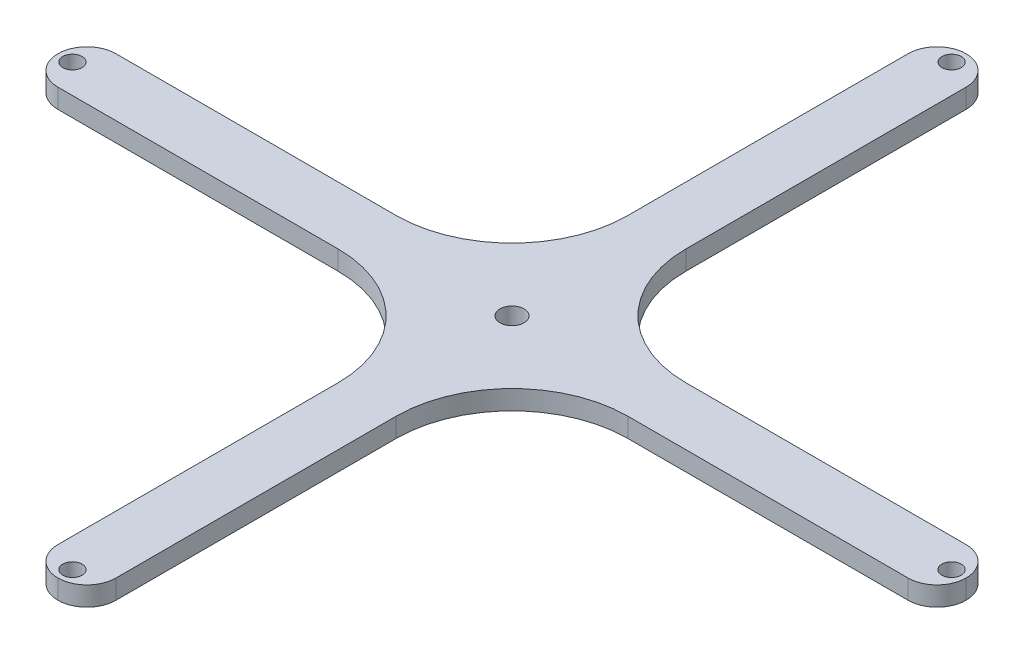
ISO-10303-21;
HEADER;
FILE_DESCRIPTION(('STEP AP214'),'2;1');
FILE_NAME('part.step','',(''),(''),'','','');
FILE_SCHEMA(('AUTOMOTIVE_DESIGN { 1 0 10303 214 1 1 1 1 }'));
ENDSEC;
DATA;
#1=APPLICATION_CONTEXT('core data for automotive mechanical design processes');
#2=APPLICATION_PROTOCOL_DEFINITION('international standard','automotive_design',2000,#1);
#3=PRODUCT_CONTEXT('',#1,'mechanical');
#4=PRODUCT('Part','Part','',(#3));
#5=PRODUCT_RELATED_PRODUCT_CATEGORY('part','',(#4));
#6=PRODUCT_DEFINITION_FORMATION('','',#4);
#7=PRODUCT_DEFINITION_CONTEXT('part definition',#1,'design');
#8=PRODUCT_DEFINITION('design','',#6,#7);
#9=PRODUCT_DEFINITION_SHAPE('','',#8);
#10=(LENGTH_UNIT() NAMED_UNIT(*) SI_UNIT(.MILLI.,.METRE.));
#11=(NAMED_UNIT(*) PLANE_ANGLE_UNIT() SI_UNIT($,.RADIAN.));
#12=(NAMED_UNIT(*) SI_UNIT($,.STERADIAN.) SOLID_ANGLE_UNIT());
#13=UNCERTAINTY_MEASURE_WITH_UNIT(LENGTH_MEASURE(1.E-05),#10,'distance_accuracy_value','');
#14=(GEOMETRIC_REPRESENTATION_CONTEXT(3) GLOBAL_UNCERTAINTY_ASSIGNED_CONTEXT((#13)) GLOBAL_UNIT_ASSIGNED_CONTEXT((#10,
#11,#12)) REPRESENTATION_CONTEXT('',''));
#15=CARTESIAN_POINT('',(0.,0.,0.));
#16=DIRECTION('',(0.,0.,1.));
#17=DIRECTION('',(1.,0.,0.));
#18=AXIS2_PLACEMENT_3D('',#15,#16,#17);
#19=CARTESIAN_POINT('',(0.,6.35,9.52500000000847));
#20=DIRECTION('',(0.,0.,1.));
#21=DIRECTION('',(1.,0.,0.));
#22=AXIS2_PLACEMENT_3D('',#19,#20,#21);
#23=PLANE('',#22);
#24=DIRECTION('',(-1.,0.,0.));
#25=VECTOR('',#24,1.);
#26=CARTESIAN_POINT('',(0.,6.35,9.52500000000847));
#27=LINE('',#26,#25);
#28=CARTESIAN_POINT('',(139.7,6.35,9.52500000000844));
#29=VERTEX_POINT('',#28);
#30=CARTESIAN_POINT('',(47.625,6.35,9.52500000000846));
#31=VERTEX_POINT('',#30);
#32=EDGE_CURVE('E399',#29,#31,#27,.T.);
#33=ORIENTED_EDGE('',*,*,#32,.T.);
#34=DIRECTION('',(0.,-1.,0.));
#35=VECTOR('',#34,1.);
#36=CARTESIAN_POINT('',(47.625,6.35,9.52500000000846));
#37=LINE('',#36,#35);
#38=CARTESIAN_POINT('',(47.625,0.,9.52500000000846));
#39=VERTEX_POINT('',#38);
#40=EDGE_CURVE('E261',#31,#39,#37,.T.);
#41=ORIENTED_EDGE('',*,*,#40,.T.);
#42=DIRECTION('',(-1.,0.,0.));
#43=VECTOR('',#42,1.);
#44=CARTESIAN_POINT('',(0.,0.,9.52500000000847));
#45=LINE('',#44,#43);
#46=CARTESIAN_POINT('',(139.7,0.,9.52500000000844));
#47=VERTEX_POINT('',#46);
#48=EDGE_CURVE('E438',#47,#39,#45,.T.);
#49=ORIENTED_EDGE('',*,*,#48,.F.);
#50=DIRECTION('',(0.,1.,0.));
#51=VECTOR('',#50,1.);
#52=CARTESIAN_POINT('',(139.7,6.35,9.52500000000844));
#53=LINE('',#52,#51);
#54=EDGE_CURVE('E249',#47,#29,#53,.T.);
#55=ORIENTED_EDGE('',*,*,#54,.T.);
#56=EDGE_LOOP('',(#33,#41,#49,#55));
#57=FACE_BOUND('',#56,.T.);
#58=ADVANCED_FACE('F36',(#57),#23,.T.);
#59=CARTESIAN_POINT('',(0.,6.35,-9.52499999999154));
#60=DIRECTION('',(0.,0.,1.));
#61=DIRECTION('',(1.,0.,0.));
#62=AXIS2_PLACEMENT_3D('',#59,#60,#61);
#63=PLANE('',#62);
#64=DIRECTION('',(-1.,0.,0.));
#65=VECTOR('',#64,1.);
#66=CARTESIAN_POINT('',(0.,0.,-9.52499999999154));
#67=LINE('',#66,#65);
#68=CARTESIAN_POINT('',(139.7,0.,-9.52499999999156));
#69=VERTEX_POINT('',#68);
#70=CARTESIAN_POINT('',(47.625,0.,-9.52499999999154));
#71=VERTEX_POINT('',#70);
#72=EDGE_CURVE('E204',#69,#71,#67,.T.);
#73=ORIENTED_EDGE('',*,*,#72,.T.);
#74=DIRECTION('',(0.,-1.,0.));
#75=VECTOR('',#74,1.);
#76=CARTESIAN_POINT('',(47.625,6.35,-9.52499999999154));
#77=LINE('',#76,#75);
#78=CARTESIAN_POINT('',(47.625,6.35,-9.52499999999154));
#79=VERTEX_POINT('',#78);
#80=EDGE_CURVE('E57',#71,#79,#77,.F.);
#81=ORIENTED_EDGE('',*,*,#80,.T.);
#82=DIRECTION('',(-1.,0.,0.));
#83=VECTOR('',#82,1.);
#84=CARTESIAN_POINT('',(0.,6.35,-9.52499999999154));
#85=LINE('',#84,#83);
#86=CARTESIAN_POINT('',(139.7,6.35,-9.52499999999156));
#87=VERTEX_POINT('',#86);
#88=EDGE_CURVE('E405',#87,#79,#85,.T.);
#89=ORIENTED_EDGE('',*,*,#88,.F.);
#90=DIRECTION('',(0.,-1.,0.));
#91=VECTOR('',#90,1.);
#92=CARTESIAN_POINT('',(139.7,6.35,-9.52499999999156));
#93=LINE('',#92,#91);
#94=EDGE_CURVE('E246',#87,#69,#93,.T.);
#95=ORIENTED_EDGE('',*,*,#94,.T.);
#96=EDGE_LOOP('',(#73,#81,#89,#95));
#97=FACE_BOUND('',#96,.T.);
#98=ADVANCED_FACE('F327',(#97),#63,.F.);
#99=CARTESIAN_POINT('',(9.52500000000001,6.35,0.));
#100=DIRECTION('',(1.,0.,0.));
#101=DIRECTION('',(0.,0.,-1.));
#102=AXIS2_PLACEMENT_3D('',#99,#100,#101);
#103=PLANE('',#102);
#104=DIRECTION('',(0.,0.,1.));
#105=VECTOR('',#104,1.);
#106=CARTESIAN_POINT('',(9.52500000000001,6.35,0.));
#107=LINE('',#106,#105);
#108=CARTESIAN_POINT('',(9.525,6.35,-139.7));
#109=VERTEX_POINT('',#108);
#110=CARTESIAN_POINT('',(9.52500000000001,6.35,-47.6249999999915));
#111=VERTEX_POINT('',#110);
#112=EDGE_CURVE('E408',#109,#111,#107,.T.);
#113=ORIENTED_EDGE('',*,*,#112,.T.);
#114=DIRECTION('',(0.,-1.,0.));
#115=VECTOR('',#114,1.);
#116=CARTESIAN_POINT('',(9.52500000000001,6.35,-47.6249999999915));
#117=LINE('',#116,#115);
#118=CARTESIAN_POINT('',(9.52500000000001,0.,-47.6249999999915));
#119=VERTEX_POINT('',#118);
#120=EDGE_CURVE('E287',#111,#119,#117,.T.);
#121=ORIENTED_EDGE('',*,*,#120,.T.);
#122=DIRECTION('',(0.,0.,1.));
#123=VECTOR('',#122,1.);
#124=CARTESIAN_POINT('',(9.52500000000001,0.,0.));
#125=LINE('',#124,#123);
#126=CARTESIAN_POINT('',(9.525,0.,-139.7));
#127=VERTEX_POINT('',#126);
#128=EDGE_CURVE('E200',#127,#119,#125,.T.);
#129=ORIENTED_EDGE('',*,*,#128,.F.);
#130=DIRECTION('',(0.,1.,0.));
#131=VECTOR('',#130,1.);
#132=CARTESIAN_POINT('',(9.525,6.35,-139.7));
#133=LINE('',#132,#131);
#134=EDGE_CURVE('E244',#127,#109,#133,.T.);
#135=ORIENTED_EDGE('',*,*,#134,.T.);
#136=EDGE_LOOP('',(#113,#121,#129,#135));
#137=FACE_BOUND('',#136,.T.);
#138=ADVANCED_FACE('F333',(#137),#103,.T.);
#139=CARTESIAN_POINT('',(-9.52500000000001,6.35,0.));
#140=DIRECTION('',(1.,0.,0.));
#141=DIRECTION('',(0.,0.,-1.));
#142=AXIS2_PLACEMENT_3D('',#139,#140,#141);
#143=PLANE('',#142);
#144=DIRECTION('',(0.,0.,1.));
#145=VECTOR('',#144,1.);
#146=CARTESIAN_POINT('',(-9.52500000000001,0.,0.));
#147=LINE('',#146,#145);
#148=CARTESIAN_POINT('',(-9.525,0.,-139.7));
#149=VERTEX_POINT('',#148);
#150=CARTESIAN_POINT('',(-9.52500000000001,0.,-47.6249999999915));
#151=VERTEX_POINT('',#150);
#152=EDGE_CURVE('E189',#149,#151,#147,.T.);
#153=ORIENTED_EDGE('',*,*,#152,.T.);
#154=DIRECTION('',(0.,-1.,0.));
#155=VECTOR('',#154,1.);
#156=CARTESIAN_POINT('',(-9.52500000000001,6.35,-47.6249999999915));
#157=LINE('',#156,#155);
#158=CARTESIAN_POINT('',(-9.52500000000001,6.35,-47.6249999999915));
#159=VERTEX_POINT('',#158);
#160=EDGE_CURVE('E285',#151,#159,#157,.F.);
#161=ORIENTED_EDGE('',*,*,#160,.T.);
#162=DIRECTION('',(0.,0.,1.));
#163=VECTOR('',#162,1.);
#164=CARTESIAN_POINT('',(-9.52500000000001,6.35,0.));
#165=LINE('',#164,#163);
#166=CARTESIAN_POINT('',(-9.525,6.35,-139.7));
#167=VERTEX_POINT('',#166);
#168=EDGE_CURVE('E192',#167,#159,#165,.T.);
#169=ORIENTED_EDGE('',*,*,#168,.F.);
#170=DIRECTION('',(0.,-1.,0.));
#171=VECTOR('',#170,1.);
#172=CARTESIAN_POINT('',(-9.525,6.35,-139.7));
#173=LINE('',#172,#171);
#174=EDGE_CURVE('E177',#167,#149,#173,.T.);
#175=ORIENTED_EDGE('',*,*,#174,.T.);
#176=EDGE_LOOP('',(#153,#161,#169,#175));
#177=FACE_BOUND('',#176,.T.);
#178=ADVANCED_FACE('F188',(#177),#143,.F.);
#179=CARTESIAN_POINT('',(0.,6.35,-9.52499999999156));
#180=DIRECTION('',(0.,0.,-1.));
#181=DIRECTION('',(-1.,0.,0.));
#182=AXIS2_PLACEMENT_3D('',#179,#180,#181);
#183=PLANE('',#182);
#184=DIRECTION('',(1.,0.,0.));
#185=VECTOR('',#184,1.);
#186=CARTESIAN_POINT('',(0.,6.35,-9.52499999999156));
#187=LINE('',#186,#185);
#188=CARTESIAN_POINT('',(-139.7,6.35,-9.52499999999151));
#189=VERTEX_POINT('',#188);
#190=CARTESIAN_POINT('',(-47.625,6.35,-9.52499999999154));
#191=VERTEX_POINT('',#190);
#192=EDGE_CURVE('E306',#189,#191,#187,.T.);
#193=ORIENTED_EDGE('',*,*,#192,.T.);
#194=DIRECTION('',(0.,-1.,0.));
#195=VECTOR('',#194,1.);
#196=CARTESIAN_POINT('',(-47.625,6.35,-9.52499999999154));
#197=LINE('',#196,#195);
#198=CARTESIAN_POINT('',(-47.625,0.,-9.52499999999154));
#199=VERTEX_POINT('',#198);
#200=EDGE_CURVE('E282',#191,#199,#197,.T.);
#201=ORIENTED_EDGE('',*,*,#200,.T.);
#202=DIRECTION('',(1.,0.,0.));
#203=VECTOR('',#202,1.);
#204=CARTESIAN_POINT('',(0.,0.,-9.52499999999156));
#205=LINE('',#204,#203);
#206=CARTESIAN_POINT('',(-139.7,0.,-9.52499999999151));
#207=VERTEX_POINT('',#206);
#208=EDGE_CURVE('E199',#207,#199,#205,.T.);
#209=ORIENTED_EDGE('',*,*,#208,.F.);
#210=DIRECTION('',(0.,1.,0.));
#211=VECTOR('',#210,1.);
#212=CARTESIAN_POINT('',(-139.7,6.35,-9.52499999999151));
#213=LINE('',#212,#211);
#214=EDGE_CURVE('E256',#207,#189,#213,.T.);
#215=ORIENTED_EDGE('',*,*,#214,.T.);
#216=EDGE_LOOP('',(#193,#201,#209,#215));
#217=FACE_BOUND('',#216,.T.);
#218=ADVANCED_FACE('F310',(#217),#183,.T.);
#219=CARTESIAN_POINT('',(0.,6.35,9.52500000000847));
#220=DIRECTION('',(0.,0.,-1.));
#221=DIRECTION('',(-1.,0.,0.));
#222=AXIS2_PLACEMENT_3D('',#219,#220,#221);
#223=PLANE('',#222);
#224=DIRECTION('',(1.,0.,0.));
#225=VECTOR('',#224,1.);
#226=CARTESIAN_POINT('',(0.,0.,9.52500000000847));
#227=LINE('',#226,#225);
#228=CARTESIAN_POINT('',(-139.7,0.,9.52500000000849));
#229=VERTEX_POINT('',#228);
#230=CARTESIAN_POINT('',(-47.625,0.,9.52500000000848));
#231=VERTEX_POINT('',#230);
#232=EDGE_CURVE('E202',#229,#231,#227,.T.);
#233=ORIENTED_EDGE('',*,*,#232,.T.);
#234=DIRECTION('',(0.,-1.,0.));
#235=VECTOR('',#234,1.);
#236=CARTESIAN_POINT('',(-47.625,6.35,9.52500000000848));
#237=LINE('',#236,#235);
#238=CARTESIAN_POINT('',(-47.625,6.35,9.52500000000848));
#239=VERTEX_POINT('',#238);
#240=EDGE_CURVE('E280',#231,#239,#237,.F.);
#241=ORIENTED_EDGE('',*,*,#240,.T.);
#242=DIRECTION('',(1.,0.,0.));
#243=VECTOR('',#242,1.);
#244=CARTESIAN_POINT('',(0.,6.35,9.52500000000847));
#245=LINE('',#244,#243);
#246=CARTESIAN_POINT('',(-139.7,6.35,9.52500000000849));
#247=VERTEX_POINT('',#246);
#248=EDGE_CURVE('E313',#247,#239,#245,.T.);
#249=ORIENTED_EDGE('',*,*,#248,.F.);
#250=DIRECTION('',(0.,-1.,0.));
#251=VECTOR('',#250,1.);
#252=CARTESIAN_POINT('',(-139.7,6.35,9.52500000000849));
#253=LINE('',#252,#251);
#254=EDGE_CURVE('E259',#247,#229,#253,.T.);
#255=ORIENTED_EDGE('',*,*,#254,.T.);
#256=EDGE_LOOP('',(#233,#241,#249,#255));
#257=FACE_BOUND('',#256,.T.);
#258=ADVANCED_FACE('F455',(#257),#223,.F.);
#259=CARTESIAN_POINT('',(-9.525,6.35,0.));
#260=DIRECTION('',(-1.,0.,0.));
#261=DIRECTION('',(0.,0.,1.));
#262=AXIS2_PLACEMENT_3D('',#259,#260,#261);
#263=PLANE('',#262);
#264=DIRECTION('',(0.,0.,-1.));
#265=VECTOR('',#264,1.);
#266=CARTESIAN_POINT('',(-9.525,6.35,0.));
#267=LINE('',#266,#265);
#268=CARTESIAN_POINT('',(-9.52499999999997,6.35,139.7));
#269=VERTEX_POINT('',#268);
#270=CARTESIAN_POINT('',(-9.52499999999999,6.35,47.6250000000085));
#271=VERTEX_POINT('',#270);
#272=EDGE_CURVE('E420',#269,#271,#267,.T.);
#273=ORIENTED_EDGE('',*,*,#272,.T.);
#274=DIRECTION('',(0.,-1.,0.));
#275=VECTOR('',#274,1.);
#276=CARTESIAN_POINT('',(-9.52499999999999,6.35,47.6250000000085));
#277=LINE('',#276,#275);
#278=CARTESIAN_POINT('',(-9.52499999999999,0.,47.6250000000085));
#279=VERTEX_POINT('',#278);
#280=EDGE_CURVE('E277',#271,#279,#277,.T.);
#281=ORIENTED_EDGE('',*,*,#280,.T.);
#282=DIRECTION('',(0.,0.,-1.));
#283=VECTOR('',#282,1.);
#284=CARTESIAN_POINT('',(-9.525,0.,0.));
#285=LINE('',#284,#283);
#286=CARTESIAN_POINT('',(-9.52499999999997,0.,139.7));
#287=VERTEX_POINT('',#286);
#288=EDGE_CURVE('E210',#287,#279,#285,.T.);
#289=ORIENTED_EDGE('',*,*,#288,.F.);
#290=DIRECTION('',(0.,1.,0.));
#291=VECTOR('',#290,1.);
#292=CARTESIAN_POINT('',(-9.52499999999997,6.35,139.7));
#293=LINE('',#292,#291);
#294=EDGE_CURVE('E254',#287,#269,#293,.T.);
#295=ORIENTED_EDGE('',*,*,#294,.T.);
#296=EDGE_LOOP('',(#273,#281,#289,#295));
#297=FACE_BOUND('',#296,.T.);
#298=ADVANCED_FACE('F342',(#297),#263,.T.);
#299=CARTESIAN_POINT('',(-2.54472745729517E-12,6.35,-144.4625));
#300=DIRECTION('',(0.,-1.,0.));
#301=DIRECTION('',(0.,0.,-1.));
#302=AXIS2_PLACEMENT_3D('',#299,#300,#301);
#303=CYLINDRICAL_SURFACE('',#302,3.17500000000647);
#304=CARTESIAN_POINT('',(-2.54472745729517E-12,6.35,-144.4625));
#305=DIRECTION('',(0.,1.,0.));
#306=DIRECTION('',(0.,0.,1.));
#307=AXIS2_PLACEMENT_3D('',#304,#305,#306);
#308=CIRCLE('',#307,3.17500000000647);
#309=CARTESIAN_POINT('',(-2.54472745729517E-12,6.35,-141.287499999994));
#310=VERTEX_POINT('',#309);
#311=EDGE_CURVE('E406',#310,#310,#308,.T.);
#312=ORIENTED_EDGE('',*,*,#311,.T.);
#313=EDGE_LOOP('',(#312));
#314=FACE_BOUND('',#313,.T.);
#315=CARTESIAN_POINT('',(-2.54472745729517E-12,0.,-144.4625));
#316=DIRECTION('',(0.,1.,0.));
#317=DIRECTION('',(0.,0.,1.));
#318=AXIS2_PLACEMENT_3D('',#315,#316,#317);
#319=CIRCLE('',#318,3.17500000000647);
#320=CARTESIAN_POINT('',(-2.54472745729517E-12,0.,-141.287499999994));
#321=VERTEX_POINT('',#320);
#322=EDGE_CURVE('E435',#321,#321,#319,.T.);
#323=ORIENTED_EDGE('',*,*,#322,.F.);
#324=EDGE_LOOP('',(#323));
#325=FACE_BOUND('',#324,.T.);
#326=ADVANCED_FACE('F338',(#314,#325),#303,.F.);
#327=CARTESIAN_POINT('',(2.55374539373746E-12,6.35,144.462500000017));
#328=DIRECTION('',(0.,-1.,0.));
#329=DIRECTION('',(0.,0.,-1.));
#330=AXIS2_PLACEMENT_3D('',#327,#328,#329);
#331=CYLINDRICAL_SURFACE('',#330,3.17500000002298);
#332=CARTESIAN_POINT('',(2.55374539373746E-12,6.35,144.462500000017));
#333=DIRECTION('',(0.,1.,0.));
#334=DIRECTION('',(0.,0.,1.));
#335=AXIS2_PLACEMENT_3D('',#332,#333,#334);
#336=CIRCLE('',#335,3.17500000002298);
#337=CARTESIAN_POINT('',(2.55374539373746E-12,6.35,147.63750000004));
#338=VERTEX_POINT('',#337);
#339=EDGE_CURVE('E411',#338,#338,#336,.T.);
#340=ORIENTED_EDGE('',*,*,#339,.T.);
#341=EDGE_LOOP('',(#340));
#342=FACE_BOUND('',#341,.T.);
#343=CARTESIAN_POINT('',(2.55374539373746E-12,0.,144.462500000017));
#344=DIRECTION('',(0.,1.,0.));
#345=DIRECTION('',(0.,0.,1.));
#346=AXIS2_PLACEMENT_3D('',#343,#344,#345);
#347=CIRCLE('',#346,3.17500000002298);
#348=CARTESIAN_POINT('',(2.55374539373746E-12,0.,147.63750000004));
#349=VERTEX_POINT('',#348);
#350=EDGE_CURVE('E432',#349,#349,#347,.T.);
#351=ORIENTED_EDGE('',*,*,#350,.F.);
#352=EDGE_LOOP('',(#351));
#353=FACE_BOUND('',#352,.T.);
#354=ADVANCED_FACE('F341',(#342,#353),#331,.F.);
#355=CARTESIAN_POINT('',(144.462500000008,6.35,5.92599147110631E-12));
#356=DIRECTION('',(0.,-1.,0.));
#357=DIRECTION('',(0.,0.,-1.));
#358=AXIS2_PLACEMENT_3D('',#355,#356,#357);
#359=CYLINDRICAL_SURFACE('',#358,3.17500000001223);
#360=CARTESIAN_POINT('',(144.462500000008,6.35,5.92599147110631E-12));
#361=DIRECTION('',(0.,1.,0.));
#362=DIRECTION('',(0.,0.,1.));
#363=AXIS2_PLACEMENT_3D('',#360,#361,#362);
#364=CIRCLE('',#363,3.17500000001223);
#365=CARTESIAN_POINT('',(144.462500000008,6.35,3.17500000001816));
#366=VERTEX_POINT('',#365);
#367=EDGE_CURVE('E482',#366,#366,#364,.T.);
#368=ORIENTED_EDGE('',*,*,#367,.T.);
#369=EDGE_LOOP('',(#368));
#370=FACE_BOUND('',#369,.T.);
#371=CARTESIAN_POINT('',(144.462500000008,0.,5.92599147110631E-12));
#372=DIRECTION('',(0.,1.,0.));
#373=DIRECTION('',(0.,0.,1.));
#374=AXIS2_PLACEMENT_3D('',#371,#372,#373);
#375=CIRCLE('',#374,3.17500000001223);
#376=CARTESIAN_POINT('',(144.462500000008,0.,3.17500000001816));
#377=VERTEX_POINT('',#376);
#378=EDGE_CURVE('E429',#377,#377,#375,.T.);
#379=ORIENTED_EDGE('',*,*,#378,.F.);
#380=EDGE_LOOP('',(#379));
#381=FACE_BOUND('',#380,.T.);
#382=ADVANCED_FACE('F346',(#370,#381),#359,.F.);
#383=CARTESIAN_POINT('',(0.,6.35,0.));
#384=DIRECTION('',(0.,-1.,0.));
#385=DIRECTION('',(0.,0.,-1.));
#386=AXIS2_PLACEMENT_3D('',#383,#384,#385);
#387=CYLINDRICAL_SURFACE('',#386,3.96875);
#388=CARTESIAN_POINT('',(0.,6.35,0.));
#389=DIRECTION('',(0.,1.,0.));
#390=DIRECTION('',(0.,0.,1.));
#391=AXIS2_PLACEMENT_3D('',#388,#389,#390);
#392=CIRCLE('',#391,3.96875);
#393=CARTESIAN_POINT('',(0.,6.35,3.96875));
#394=VERTEX_POINT('',#393);
#395=EDGE_CURVE('E478',#394,#394,#392,.T.);
#396=ORIENTED_EDGE('',*,*,#395,.T.);
#397=EDGE_LOOP('',(#396));
#398=FACE_BOUND('',#397,.T.);
#399=CARTESIAN_POINT('',(0.,0.,0.));
#400=DIRECTION('',(0.,1.,0.));
#401=DIRECTION('',(0.,0.,1.));
#402=AXIS2_PLACEMENT_3D('',#399,#400,#401);
#403=CIRCLE('',#402,3.96875);
#404=CARTESIAN_POINT('',(0.,0.,3.96875));
#405=VERTEX_POINT('',#404);
#406=EDGE_CURVE('E426',#405,#405,#403,.T.);
#407=ORIENTED_EDGE('',*,*,#406,.F.);
#408=EDGE_LOOP('',(#407));
#409=FACE_BOUND('',#408,.T.);
#410=ADVANCED_FACE('F350',(#398,#409),#387,.F.);
#411=CARTESIAN_POINT('',(-144.462500000008,6.35,1.10421558759611E-11));
#412=DIRECTION('',(0.,-1.,0.));
#413=DIRECTION('',(0.,0.,-1.));
#414=AXIS2_PLACEMENT_3D('',#411,#412,#413);
#415=CYLINDRICAL_SURFACE('',#414,3.17500000001748);
#416=CARTESIAN_POINT('',(-144.462500000008,6.35,1.10421558759611E-11));
#417=DIRECTION('',(0.,1.,0.));
#418=DIRECTION('',(0.,0.,1.));
#419=AXIS2_PLACEMENT_3D('',#416,#417,#418);
#420=CIRCLE('',#419,3.17500000001748);
#421=CARTESIAN_POINT('',(-144.462500000008,6.35,3.17500000002852));
#422=VERTEX_POINT('',#421);
#423=EDGE_CURVE('E215',#422,#422,#420,.T.);
#424=ORIENTED_EDGE('',*,*,#423,.T.);
#425=EDGE_LOOP('',(#424));
#426=FACE_BOUND('',#425,.T.);
#427=CARTESIAN_POINT('',(-144.462500000008,0.,1.10421558759611E-11));
#428=DIRECTION('',(0.,1.,0.));
#429=DIRECTION('',(0.,0.,1.));
#430=AXIS2_PLACEMENT_3D('',#427,#428,#429);
#431=CIRCLE('',#430,3.17500000001748);
#432=CARTESIAN_POINT('',(-144.462500000008,0.,3.17500000002852));
#433=VERTEX_POINT('',#432);
#434=EDGE_CURVE('E263',#433,#433,#431,.T.);
#435=ORIENTED_EDGE('',*,*,#434,.F.);
#436=EDGE_LOOP('',(#435));
#437=FACE_BOUND('',#436,.T.);
#438=ADVANCED_FACE('F354',(#426,#437),#415,.F.);
#439=CARTESIAN_POINT('',(9.52500000000001,6.35,0.));
#440=DIRECTION('',(-1.,0.,0.));
#441=DIRECTION('',(0.,0.,1.));
#442=AXIS2_PLACEMENT_3D('',#439,#440,#441);
#443=PLANE('',#442);
#444=DIRECTION('',(0.,0.,-1.));
#445=VECTOR('',#444,1.);
#446=CARTESIAN_POINT('',(9.52500000000001,0.,0.));
#447=LINE('',#446,#445);
#448=CARTESIAN_POINT('',(9.52500000000003,0.,139.7));
#449=VERTEX_POINT('',#448);
#450=CARTESIAN_POINT('',(9.52500000000002,0.,47.6250000000085));
#451=VERTEX_POINT('',#450);
#452=EDGE_CURVE('E213',#449,#451,#447,.T.);
#453=ORIENTED_EDGE('',*,*,#452,.T.);
#454=DIRECTION('',(0.,-1.,0.));
#455=VECTOR('',#454,1.);
#456=CARTESIAN_POINT('',(9.52500000000002,6.35,47.6250000000085));
#457=LINE('',#456,#455);
#458=CARTESIAN_POINT('',(9.52500000000002,6.35,47.6250000000085));
#459=VERTEX_POINT('',#458);
#460=EDGE_CURVE('E275',#451,#459,#457,.F.);
#461=ORIENTED_EDGE('',*,*,#460,.T.);
#462=DIRECTION('',(0.,0.,-1.));
#463=VECTOR('',#462,1.);
#464=CARTESIAN_POINT('',(9.52500000000001,6.35,0.));
#465=LINE('',#464,#463);
#466=CARTESIAN_POINT('',(9.52500000000003,6.35,139.7));
#467=VERTEX_POINT('',#466);
#468=EDGE_CURVE('E194',#467,#459,#465,.T.);
#469=ORIENTED_EDGE('',*,*,#468,.F.);
#470=DIRECTION('',(0.,-1.,0.));
#471=VECTOR('',#470,1.);
#472=CARTESIAN_POINT('',(9.52500000000003,6.35,139.7));
#473=LINE('',#472,#471);
#474=EDGE_CURVE('E251',#467,#449,#473,.T.);
#475=ORIENTED_EDGE('',*,*,#474,.T.);
#476=EDGE_LOOP('',(#453,#461,#469,#475));
#477=FACE_BOUND('',#476,.T.);
#478=ADVANCED_FACE('F358',(#477),#443,.F.);
#479=CARTESIAN_POINT('',(0.,6.35,0.));
#480=DIRECTION('',(0.,1.,0.));
#481=DIRECTION('',(0.,0.,1.));
#482=AXIS2_PLACEMENT_3D('',#479,#480,#481);
#483=PLANE('',#482);
#484=ORIENTED_EDGE('',*,*,#423,.F.);
#485=EDGE_LOOP('',(#484));
#486=FACE_BOUND('',#485,.T.);
#487=ORIENTED_EDGE('',*,*,#395,.F.);
#488=EDGE_LOOP('',(#487));
#489=FACE_BOUND('',#488,.T.);
#490=ORIENTED_EDGE('',*,*,#367,.F.);
#491=EDGE_LOOP('',(#490));
#492=FACE_BOUND('',#491,.T.);
#493=ORIENTED_EDGE('',*,*,#339,.F.);
#494=EDGE_LOOP('',(#493));
#495=FACE_BOUND('',#494,.T.);
#496=ORIENTED_EDGE('',*,*,#311,.F.);
#497=EDGE_LOOP('',(#496));
#498=FACE_BOUND('',#497,.T.);
#499=CARTESIAN_POINT('',(0.,6.35,-139.7));
#500=DIRECTION('',(0.,1.,0.));
#501=DIRECTION('',(0.,0.,1.));
#502=AXIS2_PLACEMENT_3D('',#499,#500,#501);
#503=CIRCLE('',#502,9.525);
#504=CARTESIAN_POINT('',(0.,6.35,-149.225));
#505=VERTEX_POINT('',#504);
#506=EDGE_CURVE('E240',#109,#505,#503,.T.);
#507=ORIENTED_EDGE('',*,*,#506,.T.);
#508=CARTESIAN_POINT('',(0.,6.35,-139.7));
#509=DIRECTION('',(0.,1.,0.));
#510=DIRECTION('',(0.,0.,1.));
#511=AXIS2_PLACEMENT_3D('',#508,#509,#510);
#512=CIRCLE('',#511,9.525);
#513=EDGE_CURVE('E242',#505,#167,#512,.T.);
#514=ORIENTED_EDGE('',*,*,#513,.T.);
#515=ORIENTED_EDGE('',*,*,#168,.T.);
#516=CARTESIAN_POINT('',(-47.625,6.35,-47.6249999999915));
#517=DIRECTION('',(0.,1.,0.));
#518=DIRECTION('',(0.,0.,1.));
#519=AXIS2_PLACEMENT_3D('',#516,#517,#518);
#520=CIRCLE('',#519,38.1);
#521=EDGE_CURVE('E300',#159,#191,#520,.F.);
#522=ORIENTED_EDGE('',*,*,#521,.T.);
#523=ORIENTED_EDGE('',*,*,#192,.F.);
#524=CARTESIAN_POINT('',(-139.7,6.35,8.48809664011852E-12));
#525=DIRECTION('',(0.,1.,0.));
#526=DIRECTION('',(0.,0.,1.));
#527=AXIS2_PLACEMENT_3D('',#524,#525,#526);
#528=CIRCLE('',#527,9.525);
#529=CARTESIAN_POINT('',(-149.225,6.35,9.07048796109755E-12));
#530=VERTEX_POINT('',#529);
#531=EDGE_CURVE('E230',#189,#530,#528,.T.);
#532=ORIENTED_EDGE('',*,*,#531,.T.);
#533=CARTESIAN_POINT('',(-139.7,6.35,8.49152064443175E-12));
#534=DIRECTION('',(0.,1.,0.));
#535=DIRECTION('',(0.,0.,1.));
#536=AXIS2_PLACEMENT_3D('',#533,#534,#535);
#537=CIRCLE('',#536,9.525);
#538=EDGE_CURVE('E182',#530,#247,#537,.T.);
#539=ORIENTED_EDGE('',*,*,#538,.T.);
#540=ORIENTED_EDGE('',*,*,#248,.T.);
#541=CARTESIAN_POINT('',(-47.625,6.35,47.6250000000085));
#542=DIRECTION('',(0.,1.,0.));
#543=DIRECTION('',(0.,0.,1.));
#544=AXIS2_PLACEMENT_3D('',#541,#542,#543);
#545=CIRCLE('',#544,38.1);
#546=EDGE_CURVE('E297',#239,#271,#545,.F.);
#547=ORIENTED_EDGE('',*,*,#546,.T.);
#548=ORIENTED_EDGE('',*,*,#272,.F.);
#549=CARTESIAN_POINT('',(0.,6.35,139.7));
#550=DIRECTION('',(0.,1.,0.));
#551=DIRECTION('',(0.,0.,1.));
#552=AXIS2_PLACEMENT_3D('',#549,#550,#551);
#553=CIRCLE('',#552,9.525);
#554=CARTESIAN_POINT('',(0.,6.35,149.225));
#555=VERTEX_POINT('',#554);
#556=EDGE_CURVE('E232',#269,#555,#553,.T.);
#557=ORIENTED_EDGE('',*,*,#556,.T.);
#558=CARTESIAN_POINT('',(0.,6.35,139.7));
#559=DIRECTION('',(0.,1.,0.));
#560=DIRECTION('',(0.,0.,1.));
#561=AXIS2_PLACEMENT_3D('',#558,#559,#560);
#562=CIRCLE('',#561,9.525);
#563=EDGE_CURVE('E234',#555,#467,#562,.T.);
#564=ORIENTED_EDGE('',*,*,#563,.T.);
#565=ORIENTED_EDGE('',*,*,#468,.T.);
#566=CARTESIAN_POINT('',(47.625,6.35,47.6250000000085));
#567=DIRECTION('',(0.,1.,0.));
#568=DIRECTION('',(0.,0.,1.));
#569=AXIS2_PLACEMENT_3D('',#566,#567,#568);
#570=CIRCLE('',#569,38.1);
#571=EDGE_CURVE('E293',#459,#31,#570,.F.);
#572=ORIENTED_EDGE('',*,*,#571,.T.);
#573=ORIENTED_EDGE('',*,*,#32,.F.);
#574=CARTESIAN_POINT('',(139.7,6.35,8.43936533355565E-12));
#575=DIRECTION('',(0.,1.,0.));
#576=DIRECTION('',(0.,0.,1.));
#577=AXIS2_PLACEMENT_3D('',#574,#575,#576);
#578=CIRCLE('',#577,9.525);
#579=CARTESIAN_POINT('',(149.225,6.35,9.01477660629808E-12));
#580=VERTEX_POINT('',#579);
#581=EDGE_CURVE('E236',#29,#580,#578,.T.);
#582=ORIENTED_EDGE('',*,*,#581,.T.);
#583=CARTESIAN_POINT('',(139.7,6.35,8.43937669421533E-12));
#584=DIRECTION('',(0.,1.,0.));
#585=DIRECTION('',(0.,0.,1.));
#586=AXIS2_PLACEMENT_3D('',#583,#584,#585);
#587=CIRCLE('',#586,9.525);
#588=EDGE_CURVE('E238',#580,#87,#587,.T.);
#589=ORIENTED_EDGE('',*,*,#588,.T.);
#590=ORIENTED_EDGE('',*,*,#88,.T.);
#591=CARTESIAN_POINT('',(47.625,6.35,-47.6249999999915));
#592=DIRECTION('',(0.,1.,0.));
#593=DIRECTION('',(0.,0.,1.));
#594=AXIS2_PLACEMENT_3D('',#591,#592,#593);
#595=CIRCLE('',#594,38.1);
#596=EDGE_CURVE('E11',#79,#111,#595,.F.);
#597=ORIENTED_EDGE('',*,*,#596,.T.);
#598=ORIENTED_EDGE('',*,*,#112,.F.);
#599=EDGE_LOOP('',(#507,#514,#515,#522,#523,#532,#539,#540,#547,#548,#557,#564,#565,#572,#573,
#582,#589,#590,#597,#598));
#600=FACE_BOUND('',#599,.T.);
#601=ADVANCED_FACE('F305',(#486,#489,#492,#495,#498,#600),#483,.T.);
#602=CARTESIAN_POINT('',(0.,0.,0.));
#603=DIRECTION('',(0.,1.,0.));
#604=DIRECTION('',(0.,0.,1.));
#605=AXIS2_PLACEMENT_3D('',#602,#603,#604);
#606=PLANE('',#605);
#607=ORIENTED_EDGE('',*,*,#434,.T.);
#608=EDGE_LOOP('',(#607));
#609=FACE_BOUND('',#608,.T.);
#610=ORIENTED_EDGE('',*,*,#406,.T.);
#611=EDGE_LOOP('',(#610));
#612=FACE_BOUND('',#611,.T.);
#613=ORIENTED_EDGE('',*,*,#378,.T.);
#614=EDGE_LOOP('',(#613));
#615=FACE_BOUND('',#614,.T.);
#616=ORIENTED_EDGE('',*,*,#350,.T.);
#617=EDGE_LOOP('',(#616));
#618=FACE_BOUND('',#617,.T.);
#619=ORIENTED_EDGE('',*,*,#322,.T.);
#620=EDGE_LOOP('',(#619));
#621=FACE_BOUND('',#620,.T.);
#622=ORIENTED_EDGE('',*,*,#152,.F.);
#623=CARTESIAN_POINT('',(0.,0.,-139.7));
#624=DIRECTION('',(0.,1.,0.));
#625=DIRECTION('',(0.,0.,1.));
#626=AXIS2_PLACEMENT_3D('',#623,#624,#625);
#627=CIRCLE('',#626,9.525);
#628=CARTESIAN_POINT('',(0.,0.,-149.225));
#629=VERTEX_POINT('',#628);
#630=EDGE_CURVE('E173',#149,#629,#627,.F.);
#631=ORIENTED_EDGE('',*,*,#630,.T.);
#632=CARTESIAN_POINT('',(0.,0.,-139.7));
#633=DIRECTION('',(0.,1.,0.));
#634=DIRECTION('',(0.,0.,1.));
#635=AXIS2_PLACEMENT_3D('',#632,#633,#634);
#636=CIRCLE('',#635,9.525);
#637=EDGE_CURVE('E183',#629,#127,#636,.F.);
#638=ORIENTED_EDGE('',*,*,#637,.T.);
#639=ORIENTED_EDGE('',*,*,#128,.T.);
#640=CARTESIAN_POINT('',(47.625,0.,-47.6249999999915));
#641=DIRECTION('',(0.,1.,0.));
#642=DIRECTION('',(0.,0.,1.));
#643=AXIS2_PLACEMENT_3D('',#640,#641,#642);
#644=CIRCLE('',#643,38.1);
#645=EDGE_CURVE('E44',#119,#71,#644,.T.);
#646=ORIENTED_EDGE('',*,*,#645,.T.);
#647=ORIENTED_EDGE('',*,*,#72,.F.);
#648=CARTESIAN_POINT('',(139.7,0.,8.43937669421533E-12));
#649=DIRECTION('',(0.,1.,0.));
#650=DIRECTION('',(0.,0.,1.));
#651=AXIS2_PLACEMENT_3D('',#648,#649,#650);
#652=CIRCLE('',#651,9.525);
#653=CARTESIAN_POINT('',(149.225,0.,9.01477660629808E-12));
#654=VERTEX_POINT('',#653);
#655=EDGE_CURVE('E226',#69,#654,#652,.F.);
#656=ORIENTED_EDGE('',*,*,#655,.T.);
#657=CARTESIAN_POINT('',(139.7,0.,8.43936533355565E-12));
#658=DIRECTION('',(0.,1.,0.));
#659=DIRECTION('',(0.,0.,1.));
#660=AXIS2_PLACEMENT_3D('',#657,#658,#659);
#661=CIRCLE('',#660,9.525);
#662=EDGE_CURVE('E224',#654,#47,#661,.F.);
#663=ORIENTED_EDGE('',*,*,#662,.T.);
#664=ORIENTED_EDGE('',*,*,#48,.T.);
#665=CARTESIAN_POINT('',(47.625,0.,47.6250000000085));
#666=DIRECTION('',(0.,1.,0.));
#667=DIRECTION('',(0.,0.,1.));
#668=AXIS2_PLACEMENT_3D('',#665,#666,#667);
#669=CIRCLE('',#668,38.1);
#670=EDGE_CURVE('E291',#39,#451,#669,.T.);
#671=ORIENTED_EDGE('',*,*,#670,.T.);
#672=ORIENTED_EDGE('',*,*,#452,.F.);
#673=CARTESIAN_POINT('',(0.,0.,139.7));
#674=DIRECTION('',(0.,1.,0.));
#675=DIRECTION('',(0.,0.,1.));
#676=AXIS2_PLACEMENT_3D('',#673,#674,#675);
#677=CIRCLE('',#676,9.525);
#678=CARTESIAN_POINT('',(0.,0.,149.225));
#679=VERTEX_POINT('',#678);
#680=EDGE_CURVE('E222',#449,#679,#677,.F.);
#681=ORIENTED_EDGE('',*,*,#680,.T.);
#682=CARTESIAN_POINT('',(0.,0.,139.7));
#683=DIRECTION('',(0.,1.,0.));
#684=DIRECTION('',(0.,0.,1.));
#685=AXIS2_PLACEMENT_3D('',#682,#683,#684);
#686=CIRCLE('',#685,9.525);
#687=EDGE_CURVE('E220',#679,#287,#686,.F.);
#688=ORIENTED_EDGE('',*,*,#687,.T.);
#689=ORIENTED_EDGE('',*,*,#288,.T.);
#690=CARTESIAN_POINT('',(-47.625,0.,47.6250000000085));
#691=DIRECTION('',(0.,1.,0.));
#692=DIRECTION('',(0.,0.,1.));
#693=AXIS2_PLACEMENT_3D('',#690,#691,#692);
#694=CIRCLE('',#693,38.1);
#695=EDGE_CURVE('E295',#279,#231,#694,.T.);
#696=ORIENTED_EDGE('',*,*,#695,.T.);
#697=ORIENTED_EDGE('',*,*,#232,.F.);
#698=CARTESIAN_POINT('',(-139.7,0.,8.49152064443175E-12));
#699=DIRECTION('',(0.,1.,0.));
#700=DIRECTION('',(0.,0.,1.));
#701=AXIS2_PLACEMENT_3D('',#698,#699,#700);
#702=CIRCLE('',#701,9.525);
#703=CARTESIAN_POINT('',(-149.225,0.,9.07048796109755E-12));
#704=VERTEX_POINT('',#703);
#705=EDGE_CURVE('E193',#229,#704,#702,.F.);
#706=ORIENTED_EDGE('',*,*,#705,.T.);
#707=CARTESIAN_POINT('',(-139.7,0.,8.48809664011852E-12));
#708=DIRECTION('',(0.,1.,0.));
#709=DIRECTION('',(0.,0.,1.));
#710=AXIS2_PLACEMENT_3D('',#707,#708,#709);
#711=CIRCLE('',#710,9.525);
#712=EDGE_CURVE('E218',#704,#207,#711,.F.);
#713=ORIENTED_EDGE('',*,*,#712,.T.);
#714=ORIENTED_EDGE('',*,*,#208,.T.);
#715=CARTESIAN_POINT('',(-47.625,0.,-47.6249999999915));
#716=DIRECTION('',(0.,1.,0.));
#717=DIRECTION('',(0.,0.,1.));
#718=AXIS2_PLACEMENT_3D('',#715,#716,#717);
#719=CIRCLE('',#718,38.1);
#720=EDGE_CURVE('E198',#199,#151,#719,.T.);
#721=ORIENTED_EDGE('',*,*,#720,.T.);
#722=EDGE_LOOP('',(#622,#631,#638,#639,#646,#647,#656,#663,#664,#671,#672,#681,#688,#689,#696,
#697,#706,#713,#714,#721));
#723=FACE_BOUND('',#722,.T.);
#724=ADVANCED_FACE('F196',(#609,#612,#615,#618,#621,#723),#606,.F.);
#725=CARTESIAN_POINT('',(0.,6.35,-139.7));
#726=DIRECTION('',(0.,-1.,0.));
#727=DIRECTION('',(0.,0.,-1.));
#728=AXIS2_PLACEMENT_3D('',#725,#726,#727);
#729=CYLINDRICAL_SURFACE('',#728,9.525);
#730=DIRECTION('',(0.,-1.,0.));
#731=VECTOR('',#730,1.);
#732=CARTESIAN_POINT('',(0.,6.35,-149.225));
#733=LINE('',#732,#731);
#734=EDGE_CURVE('E179',#505,#629,#733,.T.);
#735=ORIENTED_EDGE('',*,*,#734,.F.);
#736=ORIENTED_EDGE('',*,*,#506,.F.);
#737=ORIENTED_EDGE('',*,*,#134,.F.);
#738=ORIENTED_EDGE('',*,*,#637,.F.);
#739=EDGE_LOOP('',(#735,#736,#737,#738));
#740=FACE_BOUND('',#739,.T.);
#741=ADVANCED_FACE('F363',(#740),#729,.T.);
#742=CARTESIAN_POINT('',(0.,6.35,-139.7));
#743=DIRECTION('',(0.,-1.,0.));
#744=DIRECTION('',(0.,0.,-1.));
#745=AXIS2_PLACEMENT_3D('',#742,#743,#744);
#746=CYLINDRICAL_SURFACE('',#745,9.525);
#747=ORIENTED_EDGE('',*,*,#513,.F.);
#748=ORIENTED_EDGE('',*,*,#734,.T.);
#749=ORIENTED_EDGE('',*,*,#630,.F.);
#750=ORIENTED_EDGE('',*,*,#174,.F.);
#751=EDGE_LOOP('',(#747,#748,#749,#750));
#752=FACE_BOUND('',#751,.T.);
#753=ADVANCED_FACE('F176',(#752),#746,.T.);
#754=CARTESIAN_POINT('',(139.7,6.35,8.43936533355565E-12));
#755=DIRECTION('',(0.,-1.,0.));
#756=DIRECTION('',(0.,0.,-1.));
#757=AXIS2_PLACEMENT_3D('',#754,#755,#756);
#758=CYLINDRICAL_SURFACE('',#757,9.525);
#759=DIRECTION('',(0.,-1.,0.));
#760=VECTOR('',#759,1.);
#761=CARTESIAN_POINT('',(149.225,6.35,9.01477660629808E-12));
#762=LINE('',#761,#760);
#763=EDGE_CURVE('E264',#580,#654,#762,.T.);
#764=ORIENTED_EDGE('',*,*,#763,.F.);
#765=ORIENTED_EDGE('',*,*,#581,.F.);
#766=ORIENTED_EDGE('',*,*,#54,.F.);
#767=ORIENTED_EDGE('',*,*,#662,.F.);
#768=EDGE_LOOP('',(#764,#765,#766,#767));
#769=FACE_BOUND('',#768,.T.);
#770=ADVANCED_FACE('F362',(#769),#758,.T.);
#771=CARTESIAN_POINT('',(139.7,6.35,8.43937669421533E-12));
#772=DIRECTION('',(0.,-1.,0.));
#773=DIRECTION('',(0.,0.,-1.));
#774=AXIS2_PLACEMENT_3D('',#771,#772,#773);
#775=CYLINDRICAL_SURFACE('',#774,9.525);
#776=ORIENTED_EDGE('',*,*,#588,.F.);
#777=ORIENTED_EDGE('',*,*,#763,.T.);
#778=ORIENTED_EDGE('',*,*,#655,.F.);
#779=ORIENTED_EDGE('',*,*,#94,.F.);
#780=EDGE_LOOP('',(#776,#777,#778,#779));
#781=FACE_BOUND('',#780,.T.);
#782=ADVANCED_FACE('F367',(#781),#775,.T.);
#783=CARTESIAN_POINT('',(0.,6.35,139.7));
#784=DIRECTION('',(0.,-1.,0.));
#785=DIRECTION('',(0.,0.,-1.));
#786=AXIS2_PLACEMENT_3D('',#783,#784,#785);
#787=CYLINDRICAL_SURFACE('',#786,9.525);
#788=DIRECTION('',(0.,-1.,0.));
#789=VECTOR('',#788,1.);
#790=CARTESIAN_POINT('',(0.,6.35,149.225));
#791=LINE('',#790,#789);
#792=EDGE_CURVE('E267',#555,#679,#791,.T.);
#793=ORIENTED_EDGE('',*,*,#792,.F.);
#794=ORIENTED_EDGE('',*,*,#556,.F.);
#795=ORIENTED_EDGE('',*,*,#294,.F.);
#796=ORIENTED_EDGE('',*,*,#687,.F.);
#797=EDGE_LOOP('',(#793,#794,#795,#796));
#798=FACE_BOUND('',#797,.T.);
#799=ADVANCED_FACE('F370',(#798),#787,.T.);
#800=CARTESIAN_POINT('',(0.,6.35,139.7));
#801=DIRECTION('',(0.,-1.,0.));
#802=DIRECTION('',(0.,0.,-1.));
#803=AXIS2_PLACEMENT_3D('',#800,#801,#802);
#804=CYLINDRICAL_SURFACE('',#803,9.525);
#805=ORIENTED_EDGE('',*,*,#563,.F.);
#806=ORIENTED_EDGE('',*,*,#792,.T.);
#807=ORIENTED_EDGE('',*,*,#680,.F.);
#808=ORIENTED_EDGE('',*,*,#474,.F.);
#809=EDGE_LOOP('',(#805,#806,#807,#808));
#810=FACE_BOUND('',#809,.T.);
#811=ADVANCED_FACE('F375',(#810),#804,.T.);
#812=CARTESIAN_POINT('',(-139.7,6.35,8.49152064443175E-12));
#813=DIRECTION('',(0.,-1.,0.));
#814=DIRECTION('',(0.,0.,-1.));
#815=AXIS2_PLACEMENT_3D('',#812,#813,#814);
#816=CYLINDRICAL_SURFACE('',#815,9.525);
#817=ORIENTED_EDGE('',*,*,#254,.F.);
#818=ORIENTED_EDGE('',*,*,#538,.F.);
#819=DIRECTION('',(0.,-1.,0.));
#820=VECTOR('',#819,1.);
#821=CARTESIAN_POINT('',(-149.225,6.35,9.07048796109755E-12));
#822=LINE('',#821,#820);
#823=EDGE_CURVE('E270',#704,#530,#822,.F.);
#824=ORIENTED_EDGE('',*,*,#823,.F.);
#825=ORIENTED_EDGE('',*,*,#705,.F.);
#826=EDGE_LOOP('',(#817,#818,#824,#825));
#827=FACE_BOUND('',#826,.T.);
#828=ADVANCED_FACE('F378',(#827),#816,.T.);
#829=CARTESIAN_POINT('',(-139.7,6.35,8.48809664011852E-12));
#830=DIRECTION('',(0.,-1.,0.));
#831=DIRECTION('',(0.,0.,-1.));
#832=AXIS2_PLACEMENT_3D('',#829,#830,#831);
#833=CYLINDRICAL_SURFACE('',#832,9.525);
#834=ORIENTED_EDGE('',*,*,#531,.F.);
#835=ORIENTED_EDGE('',*,*,#214,.F.);
#836=ORIENTED_EDGE('',*,*,#712,.F.);
#837=ORIENTED_EDGE('',*,*,#823,.T.);
#838=EDGE_LOOP('',(#834,#835,#836,#837));
#839=FACE_BOUND('',#838,.T.);
#840=ADVANCED_FACE('F383',(#839),#833,.T.);
#841=CARTESIAN_POINT('',(47.625,6.35,47.6250000000085));
#842=DIRECTION('',(0.,-1.,0.));
#843=DIRECTION('',(0.,0.,-1.));
#844=AXIS2_PLACEMENT_3D('',#841,#842,#843);
#845=CYLINDRICAL_SURFACE('',#844,38.1);
#846=ORIENTED_EDGE('',*,*,#571,.F.);
#847=ORIENTED_EDGE('',*,*,#460,.F.);
#848=ORIENTED_EDGE('',*,*,#670,.F.);
#849=ORIENTED_EDGE('',*,*,#40,.F.);
#850=EDGE_LOOP('',(#846,#847,#848,#849));
#851=FACE_BOUND('',#850,.T.);
#852=ADVANCED_FACE('F323',(#851),#845,.F.);
#853=CARTESIAN_POINT('',(-47.625,6.35,47.6250000000085));
#854=DIRECTION('',(0.,-1.,0.));
#855=DIRECTION('',(0.,0.,-1.));
#856=AXIS2_PLACEMENT_3D('',#853,#854,#855);
#857=CYLINDRICAL_SURFACE('',#856,38.1);
#858=ORIENTED_EDGE('',*,*,#546,.F.);
#859=ORIENTED_EDGE('',*,*,#240,.F.);
#860=ORIENTED_EDGE('',*,*,#695,.F.);
#861=ORIENTED_EDGE('',*,*,#280,.F.);
#862=EDGE_LOOP('',(#858,#859,#860,#861));
#863=FACE_BOUND('',#862,.T.);
#864=ADVANCED_FACE('F317',(#863),#857,.F.);
#865=CARTESIAN_POINT('',(-47.625,6.35,-47.6249999999915));
#866=DIRECTION('',(0.,-1.,0.));
#867=DIRECTION('',(0.,0.,-1.));
#868=AXIS2_PLACEMENT_3D('',#865,#866,#867);
#869=CYLINDRICAL_SURFACE('',#868,38.1);
#870=ORIENTED_EDGE('',*,*,#521,.F.);
#871=ORIENTED_EDGE('',*,*,#160,.F.);
#872=ORIENTED_EDGE('',*,*,#720,.F.);
#873=ORIENTED_EDGE('',*,*,#200,.F.);
#874=EDGE_LOOP('',(#870,#871,#872,#873));
#875=FACE_BOUND('',#874,.T.);
#876=ADVANCED_FACE('F315',(#875),#869,.F.);
#877=CARTESIAN_POINT('',(47.625,6.35,-47.6249999999915));
#878=DIRECTION('',(0.,-1.,0.));
#879=DIRECTION('',(0.,0.,-1.));
#880=AXIS2_PLACEMENT_3D('',#877,#878,#879);
#881=CYLINDRICAL_SURFACE('',#880,38.1);
#882=ORIENTED_EDGE('',*,*,#596,.F.);
#883=ORIENTED_EDGE('',*,*,#80,.F.);
#884=ORIENTED_EDGE('',*,*,#645,.F.);
#885=ORIENTED_EDGE('',*,*,#120,.F.);
#886=EDGE_LOOP('',(#882,#883,#884,#885));
#887=FACE_BOUND('',#886,.T.);
#888=ADVANCED_FACE('F38',(#887),#881,.F.);
#889=CLOSED_SHELL('',(#58,#98,#138,#178,#218,#258,#298,#326,#354,#382,#410,#438,#478,#601,#724,
#741,#753,#770,#782,#799,#811,#828,#840,#852,#864,#876,#888));
#890=MANIFOLD_SOLID_BREP('B2',#889);
#891=ADVANCED_BREP_SHAPE_REPRESENTATION('',(#18,#890),#14);
#892=SHAPE_DEFINITION_REPRESENTATION(#9,#891);
ENDSEC;
END-ISO-10303-21;
